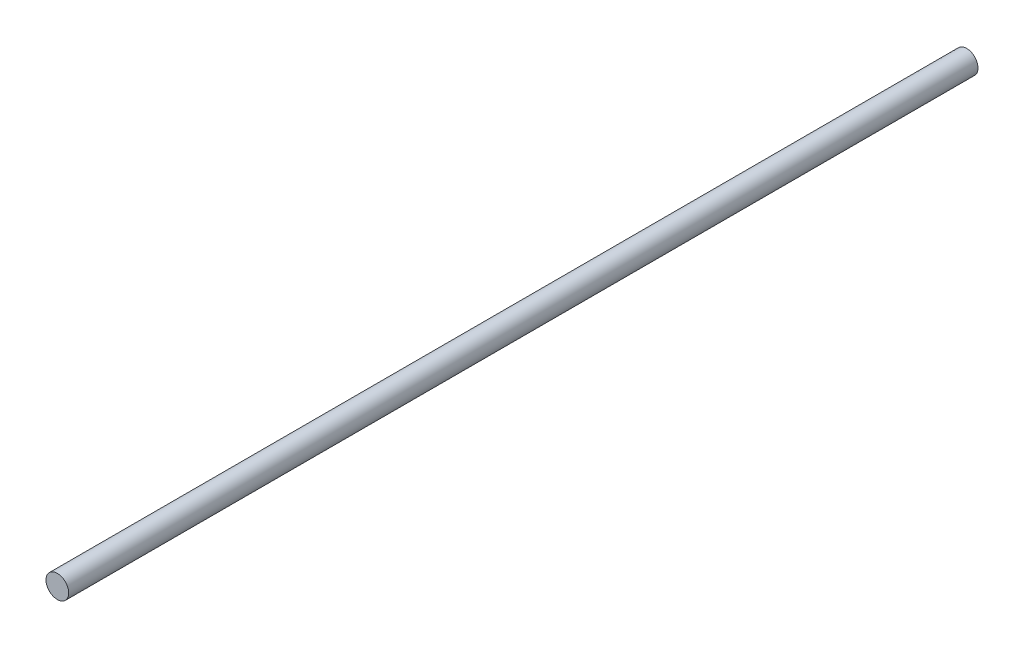
ISO-10303-21;
HEADER;
FILE_DESCRIPTION(('STEP AP214'),'2;1');
FILE_NAME('part.step','',(''),(''),'','','');
FILE_SCHEMA(('AUTOMOTIVE_DESIGN { 1 0 10303 214 1 1 1 1 }'));
ENDSEC;
DATA;
#1=APPLICATION_CONTEXT('core data for automotive mechanical design processes');
#2=APPLICATION_PROTOCOL_DEFINITION('international standard','automotive_design',2000,#1);
#3=PRODUCT_CONTEXT('',#1,'mechanical');
#4=PRODUCT('Part','Part','',(#3));
#5=PRODUCT_RELATED_PRODUCT_CATEGORY('part','',(#4));
#6=PRODUCT_DEFINITION_FORMATION('','',#4);
#7=PRODUCT_DEFINITION_CONTEXT('part definition',#1,'design');
#8=PRODUCT_DEFINITION('design','',#6,#7);
#9=PRODUCT_DEFINITION_SHAPE('','',#8);
#10=(LENGTH_UNIT() NAMED_UNIT(*) SI_UNIT(.MILLI.,.METRE.));
#11=(NAMED_UNIT(*) PLANE_ANGLE_UNIT() SI_UNIT($,.RADIAN.));
#12=(NAMED_UNIT(*) SI_UNIT($,.STERADIAN.) SOLID_ANGLE_UNIT());
#13=UNCERTAINTY_MEASURE_WITH_UNIT(LENGTH_MEASURE(1.E-05),#10,'distance_accuracy_value','');
#14=(GEOMETRIC_REPRESENTATION_CONTEXT(3) GLOBAL_UNCERTAINTY_ASSIGNED_CONTEXT((#13)) GLOBAL_UNIT_ASSIGNED_CONTEXT((#10,
#11,#12)) REPRESENTATION_CONTEXT('',''));
#15=CARTESIAN_POINT('',(0.,0.,0.));
#16=DIRECTION('',(0.,0.,1.));
#17=DIRECTION('',(1.,0.,0.));
#18=AXIS2_PLACEMENT_3D('',#15,#16,#17);
#19=CARTESIAN_POINT('',(0.,0.,320.));
#20=DIRECTION('',(0.,0.,-1.));
#21=DIRECTION('',(-1.,0.,0.));
#22=AXIS2_PLACEMENT_3D('',#19,#20,#21);
#23=CYLINDRICAL_SURFACE('',#22,4.);
#24=CARTESIAN_POINT('',(0.,0.,320.));
#25=DIRECTION('',(0.,0.,1.));
#26=DIRECTION('',(1.,0.,0.));
#27=AXIS2_PLACEMENT_3D('',#24,#25,#26);
#28=CIRCLE('',#27,4.);
#29=CARTESIAN_POINT('',(4.,0.,320.));
#30=VERTEX_POINT('',#29);
#31=EDGE_CURVE('E10',#30,#30,#28,.T.);
#32=ORIENTED_EDGE('',*,*,#31,.F.);
#33=EDGE_LOOP('',(#32));
#34=FACE_BOUND('',#33,.T.);
#35=CARTESIAN_POINT('',(0.,0.,0.));
#36=DIRECTION('',(0.,0.,1.));
#37=DIRECTION('',(1.,0.,0.));
#38=AXIS2_PLACEMENT_3D('',#35,#36,#37);
#39=CIRCLE('',#38,4.);
#40=CARTESIAN_POINT('',(4.,0.,0.));
#41=VERTEX_POINT('',#40);
#42=EDGE_CURVE('E32',#41,#41,#39,.T.);
#43=ORIENTED_EDGE('',*,*,#42,.T.);
#44=EDGE_LOOP('',(#43));
#45=FACE_BOUND('',#44,.T.);
#46=ADVANCED_FACE('F29',(#34,#45),#23,.T.);
#47=CARTESIAN_POINT('',(0.,0.,320.));
#48=DIRECTION('',(0.,0.,1.));
#49=DIRECTION('',(1.,0.,0.));
#50=AXIS2_PLACEMENT_3D('',#47,#48,#49);
#51=PLANE('',#50);
#52=ORIENTED_EDGE('',*,*,#31,.T.);
#53=EDGE_LOOP('',(#52));
#54=FACE_BOUND('',#53,.T.);
#55=ADVANCED_FACE('F44',(#54),#51,.T.);
#56=CARTESIAN_POINT('',(0.,0.,0.));
#57=DIRECTION('',(0.,0.,1.));
#58=DIRECTION('',(1.,0.,0.));
#59=AXIS2_PLACEMENT_3D('',#56,#57,#58);
#60=PLANE('',#59);
#61=ORIENTED_EDGE('',*,*,#42,.F.);
#62=EDGE_LOOP('',(#61));
#63=FACE_BOUND('',#62,.T.);
#64=ADVANCED_FACE('F42',(#63),#60,.F.);
#65=CLOSED_SHELL('',(#46,#55,#64));
#66=MANIFOLD_SOLID_BREP('B2',#65);
#67=ADVANCED_BREP_SHAPE_REPRESENTATION('',(#18,#66),#14);
#68=SHAPE_DEFINITION_REPRESENTATION(#9,#67);
ENDSEC;
END-ISO-10303-21;
